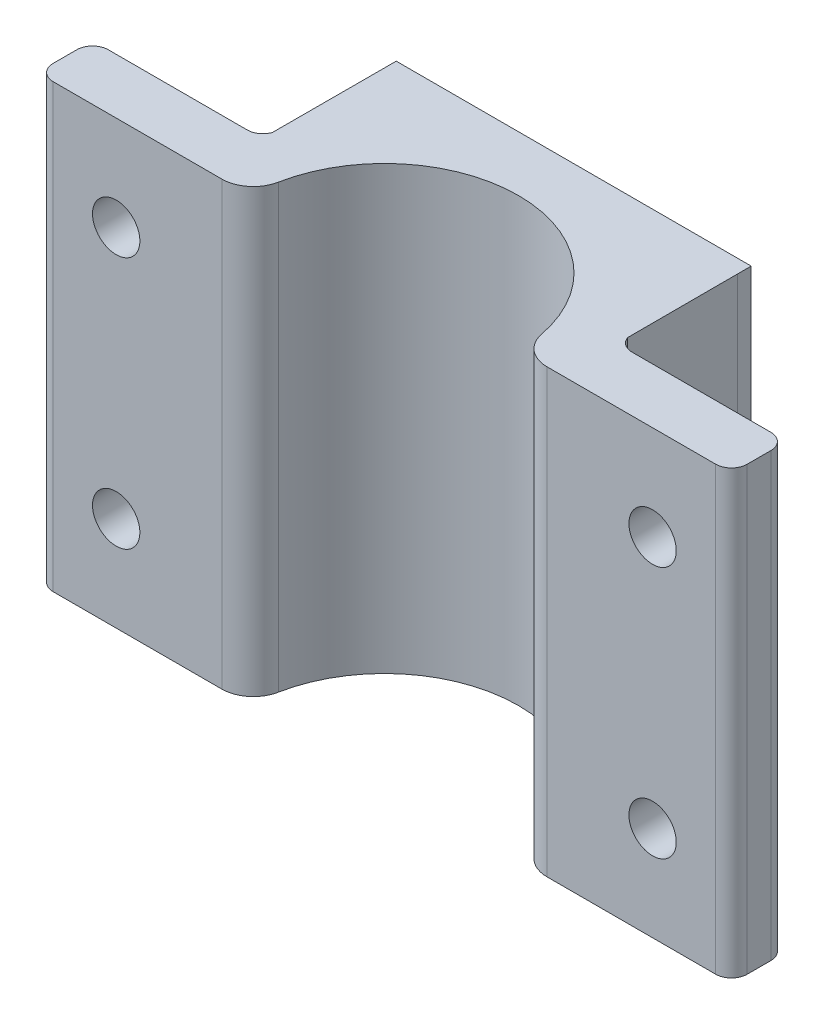
ISO-10303-21;
HEADER;
FILE_DESCRIPTION(('STEP AP214'),'2;1');
FILE_NAME('part.step','',(''),(''),'','','');
FILE_SCHEMA(('AUTOMOTIVE_DESIGN { 1 0 10303 214 1 1 1 1 }'));
ENDSEC;
DATA;
#1=APPLICATION_CONTEXT('core data for automotive mechanical design processes');
#2=APPLICATION_PROTOCOL_DEFINITION('international standard','automotive_design',2000,#1);
#3=PRODUCT_CONTEXT('',#1,'mechanical');
#4=PRODUCT('Part','Part','',(#3));
#5=PRODUCT_RELATED_PRODUCT_CATEGORY('part','',(#4));
#6=PRODUCT_DEFINITION_FORMATION('','',#4);
#7=PRODUCT_DEFINITION_CONTEXT('part definition',#1,'design');
#8=PRODUCT_DEFINITION('design','',#6,#7);
#9=PRODUCT_DEFINITION_SHAPE('','',#8);
#10=(LENGTH_UNIT() NAMED_UNIT(*) SI_UNIT(.MILLI.,.METRE.));
#11=(NAMED_UNIT(*) PLANE_ANGLE_UNIT() SI_UNIT($,.RADIAN.));
#12=(NAMED_UNIT(*) SI_UNIT($,.STERADIAN.) SOLID_ANGLE_UNIT());
#13=UNCERTAINTY_MEASURE_WITH_UNIT(LENGTH_MEASURE(1.E-05),#10,'distance_accuracy_value','');
#14=(GEOMETRIC_REPRESENTATION_CONTEXT(3) GLOBAL_UNCERTAINTY_ASSIGNED_CONTEXT((#13)) GLOBAL_UNIT_ASSIGNED_CONTEXT((#10,
#11,#12)) REPRESENTATION_CONTEXT('',''));
#15=CARTESIAN_POINT('',(0.,0.,0.));
#16=DIRECTION('',(0.,0.,1.));
#17=DIRECTION('',(1.,0.,0.));
#18=AXIS2_PLACEMENT_3D('',#15,#16,#17);
#19=CARTESIAN_POINT('',(11.478240283249,28.,-3.5));
#20=DIRECTION('',(0.,0.,1.));
#21=DIRECTION('',(1.,0.,0.));
#22=AXIS2_PLACEMENT_3D('',#19,#20,#21);
#23=PLANE('',#22);
#24=CARTESIAN_POINT('',(17.,22.,-3.5));
#25=DIRECTION('',(0.,0.,-1.));
#26=DIRECTION('',(-1.,0.,0.));
#27=AXIS2_PLACEMENT_3D('',#24,#25,#26);
#28=CIRCLE('',#27,1.5);
#29=CARTESIAN_POINT('',(15.5,22.,-3.5));
#30=VERTEX_POINT('',#29);
#31=EDGE_CURVE('E470',#30,#30,#28,.T.);
#32=ORIENTED_EDGE('',*,*,#31,.F.);
#33=EDGE_LOOP('',(#32));
#34=FACE_BOUND('',#33,.T.);
#35=DIRECTION('',(-1.,0.,0.));
#36=VECTOR('',#35,1.);
#37=CARTESIAN_POINT('',(11.478240283249,28.,-3.5));
#38=LINE('',#37,#36);
#39=CARTESIAN_POINT('',(21.,28.,-3.5));
#40=VERTEX_POINT('',#39);
#41=CARTESIAN_POINT('',(12.1963109176505,28.,-3.5));
#42=VERTEX_POINT('',#41);
#43=EDGE_CURVE('E238',#40,#42,#38,.T.);
#44=ORIENTED_EDGE('',*,*,#43,.F.);
#45=DIRECTION('',(0.,-1.,0.));
#46=VECTOR('',#45,1.);
#47=CARTESIAN_POINT('',(21.,28.,-3.5));
#48=LINE('',#47,#46);
#49=CARTESIAN_POINT('',(21.,0.,-3.5));
#50=VERTEX_POINT('',#49);
#51=EDGE_CURVE('E11',#40,#50,#48,.T.);
#52=ORIENTED_EDGE('',*,*,#51,.T.);
#53=DIRECTION('',(-1.,0.,0.));
#54=VECTOR('',#53,1.);
#55=CARTESIAN_POINT('',(11.478240283249,0.,-3.5));
#56=LINE('',#55,#54);
#57=CARTESIAN_POINT('',(12.1963109176505,0.,-3.5));
#58=VERTEX_POINT('',#57);
#59=EDGE_CURVE('E256',#50,#58,#56,.T.);
#60=ORIENTED_EDGE('',*,*,#59,.T.);
#61=DIRECTION('',(0.,1.,0.));
#62=VECTOR('',#61,1.);
#63=CARTESIAN_POINT('',(12.1963109176505,28.,-3.5));
#64=LINE('',#63,#62);
#65=EDGE_CURVE('E287',#58,#42,#64,.T.);
#66=ORIENTED_EDGE('',*,*,#65,.T.);
#67=EDGE_LOOP('',(#44,#52,#60,#66));
#68=FACE_BOUND('',#67,.T.);
#69=CARTESIAN_POINT('',(17.,6.,-3.5));
#70=DIRECTION('',(0.,0.,-1.));
#71=DIRECTION('',(-1.,0.,0.));
#72=AXIS2_PLACEMENT_3D('',#69,#70,#71);
#73=CIRCLE('',#72,1.5);
#74=CARTESIAN_POINT('',(15.5,6.,-3.5));
#75=VERTEX_POINT('',#74);
#76=EDGE_CURVE('E481',#75,#75,#73,.T.);
#77=ORIENTED_EDGE('',*,*,#76,.F.);
#78=EDGE_LOOP('',(#77));
#79=FACE_BOUND('',#78,.T.);
#80=ADVANCED_FACE('F35',(#34,#68,#79),#23,.F.);
#81=CARTESIAN_POINT('',(0.,28.,0.));
#82=DIRECTION('',(0.,-1.,0.));
#83=DIRECTION('',(0.,0.,-1.));
#84=AXIS2_PLACEMENT_3D('',#81,#82,#83);
#85=CYLINDRICAL_SURFACE('',#84,8.5);
#86=CARTESIAN_POINT('',(0.,0.,0.));
#87=DIRECTION('',(0.,-1.,0.));
#88=DIRECTION('',(0.,0.,1.));
#89=AXIS2_PLACEMENT_3D('',#86,#87,#88);
#90=CIRCLE('',#89,8.5);
#91=CARTESIAN_POINT('',(-8.34438043279765,0.,-1.61904761904762));
#92=VERTEX_POINT('',#91);
#93=CARTESIAN_POINT('',(8.34438043279765,0.,-1.61904761904762));
#94=VERTEX_POINT('',#93);
#95=EDGE_CURVE('E224',#92,#94,#90,.T.);
#96=ORIENTED_EDGE('',*,*,#95,.T.);
#97=DIRECTION('',(0.,-1.,0.));
#98=VECTOR('',#97,1.);
#99=CARTESIAN_POINT('',(8.34438043279765,28.,-1.61904761904762));
#100=LINE('',#99,#98);
#101=CARTESIAN_POINT('',(8.34438043279765,28.,-1.61904761904762));
#102=VERTEX_POINT('',#101);
#103=EDGE_CURVE('E274',#94,#102,#100,.F.);
#104=ORIENTED_EDGE('',*,*,#103,.T.);
#105=CARTESIAN_POINT('',(0.,28.,0.));
#106=DIRECTION('',(0.,-1.,0.));
#107=DIRECTION('',(0.,0.,1.));
#108=AXIS2_PLACEMENT_3D('',#105,#106,#107);
#109=CIRCLE('',#108,8.5);
#110=CARTESIAN_POINT('',(-8.34438043279765,28.,-1.61904761904762));
#111=VERTEX_POINT('',#110);
#112=EDGE_CURVE('E229',#111,#102,#109,.T.);
#113=ORIENTED_EDGE('',*,*,#112,.F.);
#114=DIRECTION('',(0.,-1.,0.));
#115=VECTOR('',#114,1.);
#116=CARTESIAN_POINT('',(-8.34438043279765,28.,-1.61904761904762));
#117=LINE('',#116,#115);
#118=EDGE_CURVE('E271',#111,#92,#117,.T.);
#119=ORIENTED_EDGE('',*,*,#118,.T.);
#120=EDGE_LOOP('',(#96,#104,#113,#119));
#121=FACE_BOUND('',#120,.T.);
#122=ADVANCED_FACE('F370',(#121),#85,.F.);
#123=CARTESIAN_POINT('',(8.5,28.,0.));
#124=DIRECTION('',(0.,0.,-1.));
#125=DIRECTION('',(-1.,0.,0.));
#126=AXIS2_PLACEMENT_3D('',#123,#124,#125);
#127=PLANE('',#126);
#128=CARTESIAN_POINT('',(17.,22.,0.));
#129=DIRECTION('',(0.,0.,-1.));
#130=DIRECTION('',(-1.,0.,0.));
#131=AXIS2_PLACEMENT_3D('',#128,#129,#130);
#132=CIRCLE('',#131,1.5);
#133=CARTESIAN_POINT('',(15.5,22.,0.));
#134=VERTEX_POINT('',#133);
#135=EDGE_CURVE('E478',#134,#134,#132,.T.);
#136=ORIENTED_EDGE('',*,*,#135,.T.);
#137=EDGE_LOOP('',(#136));
#138=FACE_BOUND('',#137,.T.);
#139=CARTESIAN_POINT('',(17.,6.,0.));
#140=DIRECTION('',(0.,0.,-1.));
#141=DIRECTION('',(-1.,0.,0.));
#142=AXIS2_PLACEMENT_3D('',#139,#140,#141);
#143=CIRCLE('',#142,1.5);
#144=CARTESIAN_POINT('',(15.5,6.,0.));
#145=VERTEX_POINT('',#144);
#146=EDGE_CURVE('E484',#145,#145,#143,.T.);
#147=ORIENTED_EDGE('',*,*,#146,.T.);
#148=EDGE_LOOP('',(#147));
#149=FACE_BOUND('',#148,.T.);
#150=DIRECTION('',(1.,0.,0.));
#151=VECTOR('',#150,1.);
#152=CARTESIAN_POINT('',(8.5,0.,0.));
#153=LINE('',#152,#151);
#154=CARTESIAN_POINT('',(10.3077640640442,0.,0.));
#155=VERTEX_POINT('',#154);
#156=CARTESIAN_POINT('',(21.,0.,0.));
#157=VERTEX_POINT('',#156);
#158=EDGE_CURVE('E250',#155,#157,#153,.T.);
#159=ORIENTED_EDGE('',*,*,#158,.T.);
#160=DIRECTION('',(0.,-1.,0.));
#161=VECTOR('',#160,1.);
#162=CARTESIAN_POINT('',(21.,28.,0.));
#163=LINE('',#162,#161);
#164=CARTESIAN_POINT('',(21.,28.,0.));
#165=VERTEX_POINT('',#164);
#166=EDGE_CURVE('E43',#157,#165,#163,.F.);
#167=ORIENTED_EDGE('',*,*,#166,.T.);
#168=DIRECTION('',(1.,0.,0.));
#169=VECTOR('',#168,1.);
#170=CARTESIAN_POINT('',(8.5,28.,0.));
#171=LINE('',#170,#169);
#172=CARTESIAN_POINT('',(10.3077640640442,28.,0.));
#173=VERTEX_POINT('',#172);
#174=EDGE_CURVE('E232',#173,#165,#171,.T.);
#175=ORIENTED_EDGE('',*,*,#174,.F.);
#176=DIRECTION('',(0.,-1.,0.));
#177=VECTOR('',#176,1.);
#178=CARTESIAN_POINT('',(10.3077640640442,28.,0.));
#179=LINE('',#178,#177);
#180=EDGE_CURVE('E247',#173,#155,#179,.T.);
#181=ORIENTED_EDGE('',*,*,#180,.T.);
#182=EDGE_LOOP('',(#159,#167,#175,#181));
#183=FACE_BOUND('',#182,.T.);
#184=ADVANCED_FACE('F332',(#138,#149,#183),#127,.F.);
#185=CARTESIAN_POINT('',(22.,28.,0.));
#186=DIRECTION('',(-1.,0.,0.));
#187=DIRECTION('',(0.,0.,1.));
#188=AXIS2_PLACEMENT_3D('',#185,#186,#187);
#189=PLANE('',#188);
#190=DIRECTION('',(0.,0.,-1.));
#191=VECTOR('',#190,1.);
#192=CARTESIAN_POINT('',(22.,28.,0.));
#193=LINE('',#192,#191);
#194=CARTESIAN_POINT('',(22.,28.,-1.));
#195=VERTEX_POINT('',#194);
#196=CARTESIAN_POINT('',(22.,28.,-2.5));
#197=VERTEX_POINT('',#196);
#198=EDGE_CURVE('E236',#195,#197,#193,.T.);
#199=ORIENTED_EDGE('',*,*,#198,.F.);
#200=DIRECTION('',(0.,-1.,0.));
#201=VECTOR('',#200,1.);
#202=CARTESIAN_POINT('',(22.,28.,-1.));
#203=LINE('',#202,#201);
#204=CARTESIAN_POINT('',(22.,0.,-1.));
#205=VERTEX_POINT('',#204);
#206=EDGE_CURVE('E327',#195,#205,#203,.T.);
#207=ORIENTED_EDGE('',*,*,#206,.T.);
#208=DIRECTION('',(0.,0.,-1.));
#209=VECTOR('',#208,1.);
#210=CARTESIAN_POINT('',(22.,0.,0.));
#211=LINE('',#210,#209);
#212=CARTESIAN_POINT('',(22.,0.,-2.5));
#213=VERTEX_POINT('',#212);
#214=EDGE_CURVE('E253',#205,#213,#211,.T.);
#215=ORIENTED_EDGE('',*,*,#214,.T.);
#216=DIRECTION('',(0.,-1.,0.));
#217=VECTOR('',#216,1.);
#218=CARTESIAN_POINT('',(22.,28.,-2.5));
#219=LINE('',#218,#217);
#220=EDGE_CURVE('E325',#213,#197,#219,.F.);
#221=ORIENTED_EDGE('',*,*,#220,.T.);
#222=EDGE_LOOP('',(#199,#207,#215,#221));
#223=FACE_BOUND('',#222,.T.);
#224=ADVANCED_FACE('F344',(#223),#189,.F.);
#225=CARTESIAN_POINT('',(-22.,28.,-3.5));
#226=DIRECTION('',(0.,0.,1.));
#227=DIRECTION('',(1.,0.,0.));
#228=AXIS2_PLACEMENT_3D('',#225,#226,#227);
#229=PLANE('',#228);
#230=CARTESIAN_POINT('',(-17.,6.,-3.5));
#231=DIRECTION('',(0.,0.,-1.));
#232=DIRECTION('',(-1.,0.,0.));
#233=AXIS2_PLACEMENT_3D('',#230,#231,#232);
#234=CIRCLE('',#233,1.5);
#235=CARTESIAN_POINT('',(-18.5,6.,-3.5));
#236=VERTEX_POINT('',#235);
#237=EDGE_CURVE('E461',#236,#236,#234,.T.);
#238=ORIENTED_EDGE('',*,*,#237,.F.);
#239=EDGE_LOOP('',(#238));
#240=FACE_BOUND('',#239,.T.);
#241=CARTESIAN_POINT('',(-17.,22.,-3.5));
#242=DIRECTION('',(0.,0.,-1.));
#243=DIRECTION('',(-1.,0.,0.));
#244=AXIS2_PLACEMENT_3D('',#241,#242,#243);
#245=CIRCLE('',#244,1.5);
#246=CARTESIAN_POINT('',(-18.5,22.,-3.5));
#247=VERTEX_POINT('',#246);
#248=EDGE_CURVE('E464',#247,#247,#245,.T.);
#249=ORIENTED_EDGE('',*,*,#248,.F.);
#250=EDGE_LOOP('',(#249));
#251=FACE_BOUND('',#250,.T.);
#252=DIRECTION('',(-1.,0.,0.));
#253=VECTOR('',#252,1.);
#254=CARTESIAN_POINT('',(-22.,0.,-3.5));
#255=LINE('',#254,#253);
#256=CARTESIAN_POINT('',(-12.1963109176505,0.,-3.5));
#257=VERTEX_POINT('',#256);
#258=CARTESIAN_POINT('',(-21.,0.,-3.5));
#259=VERTEX_POINT('',#258);
#260=EDGE_CURVE('E258',#257,#259,#255,.T.);
#261=ORIENTED_EDGE('',*,*,#260,.T.);
#262=DIRECTION('',(0.,-1.,0.));
#263=VECTOR('',#262,1.);
#264=CARTESIAN_POINT('',(-21.,28.,-3.5));
#265=LINE('',#264,#263);
#266=CARTESIAN_POINT('',(-21.,28.,-3.5));
#267=VERTEX_POINT('',#266);
#268=EDGE_CURVE('E50',#259,#267,#265,.F.);
#269=ORIENTED_EDGE('',*,*,#268,.T.);
#270=DIRECTION('',(-1.,0.,0.));
#271=VECTOR('',#270,1.);
#272=CARTESIAN_POINT('',(-22.,28.,-3.5));
#273=LINE('',#272,#271);
#274=CARTESIAN_POINT('',(-12.1963109176505,28.,-3.5));
#275=VERTEX_POINT('',#274);
#276=EDGE_CURVE('E240',#275,#267,#273,.T.);
#277=ORIENTED_EDGE('',*,*,#276,.F.);
#278=DIRECTION('',(0.,1.,0.));
#279=VECTOR('',#278,1.);
#280=CARTESIAN_POINT('',(-12.1963109176505,0.,-3.5));
#281=LINE('',#280,#279);
#282=EDGE_CURVE('E290',#275,#257,#281,.F.);
#283=ORIENTED_EDGE('',*,*,#282,.T.);
#284=EDGE_LOOP('',(#261,#269,#277,#283));
#285=FACE_BOUND('',#284,.T.);
#286=ADVANCED_FACE('F381',(#240,#251,#285),#229,.F.);
#287=CARTESIAN_POINT('',(-22.,28.,0.));
#288=DIRECTION('',(1.,0.,0.));
#289=DIRECTION('',(0.,0.,-1.));
#290=AXIS2_PLACEMENT_3D('',#287,#288,#289);
#291=PLANE('',#290);
#292=DIRECTION('',(0.,0.,1.));
#293=VECTOR('',#292,1.);
#294=CARTESIAN_POINT('',(-22.,0.,0.));
#295=LINE('',#294,#293);
#296=CARTESIAN_POINT('',(-22.,0.,-2.5));
#297=VERTEX_POINT('',#296);
#298=CARTESIAN_POINT('',(-22.,0.,-1.));
#299=VERTEX_POINT('',#298);
#300=EDGE_CURVE('E260',#297,#299,#295,.T.);
#301=ORIENTED_EDGE('',*,*,#300,.T.);
#302=DIRECTION('',(0.,-1.,0.));
#303=VECTOR('',#302,1.);
#304=CARTESIAN_POINT('',(-22.,28.,-1.));
#305=LINE('',#304,#303);
#306=CARTESIAN_POINT('',(-22.,28.,-1.));
#307=VERTEX_POINT('',#306);
#308=EDGE_CURVE('E315',#299,#307,#305,.F.);
#309=ORIENTED_EDGE('',*,*,#308,.T.);
#310=DIRECTION('',(0.,0.,1.));
#311=VECTOR('',#310,1.);
#312=CARTESIAN_POINT('',(-22.,28.,0.));
#313=LINE('',#312,#311);
#314=CARTESIAN_POINT('',(-22.,28.,-2.5));
#315=VERTEX_POINT('',#314);
#316=EDGE_CURVE('E242',#315,#307,#313,.T.);
#317=ORIENTED_EDGE('',*,*,#316,.F.);
#318=DIRECTION('',(0.,-1.,0.));
#319=VECTOR('',#318,1.);
#320=CARTESIAN_POINT('',(-22.,28.,-2.5));
#321=LINE('',#320,#319);
#322=EDGE_CURVE('E312',#315,#297,#321,.T.);
#323=ORIENTED_EDGE('',*,*,#322,.T.);
#324=EDGE_LOOP('',(#301,#309,#317,#323));
#325=FACE_BOUND('',#324,.T.);
#326=ADVANCED_FACE('F410',(#325),#291,.F.);
#327=CARTESIAN_POINT('',(-22.,28.,0.));
#328=DIRECTION('',(0.,0.,-1.));
#329=DIRECTION('',(-1.,0.,0.));
#330=AXIS2_PLACEMENT_3D('',#327,#328,#329);
#331=PLANE('',#330);
#332=CARTESIAN_POINT('',(-17.,6.,0.));
#333=DIRECTION('',(0.,0.,-1.));
#334=DIRECTION('',(-1.,0.,0.));
#335=AXIS2_PLACEMENT_3D('',#332,#333,#334);
#336=CIRCLE('',#335,1.5);
#337=CARTESIAN_POINT('',(-18.5,6.,0.));
#338=VERTEX_POINT('',#337);
#339=EDGE_CURVE('E467',#338,#338,#336,.T.);
#340=ORIENTED_EDGE('',*,*,#339,.T.);
#341=EDGE_LOOP('',(#340));
#342=FACE_BOUND('',#341,.T.);
#343=CARTESIAN_POINT('',(-17.,22.,0.));
#344=DIRECTION('',(0.,0.,-1.));
#345=DIRECTION('',(-1.,0.,0.));
#346=AXIS2_PLACEMENT_3D('',#343,#344,#345);
#347=CIRCLE('',#346,1.5);
#348=CARTESIAN_POINT('',(-18.5,22.,0.));
#349=VERTEX_POINT('',#348);
#350=EDGE_CURVE('E466',#349,#349,#347,.T.);
#351=ORIENTED_EDGE('',*,*,#350,.T.);
#352=EDGE_LOOP('',(#351));
#353=FACE_BOUND('',#352,.T.);
#354=DIRECTION('',(1.,0.,0.));
#355=VECTOR('',#354,1.);
#356=CARTESIAN_POINT('',(-22.,28.,0.));
#357=LINE('',#356,#355);
#358=CARTESIAN_POINT('',(-21.,28.,0.));
#359=VERTEX_POINT('',#358);
#360=CARTESIAN_POINT('',(-10.3077640640442,28.,0.));
#361=VERTEX_POINT('',#360);
#362=EDGE_CURVE('E245',#359,#361,#357,.T.);
#363=ORIENTED_EDGE('',*,*,#362,.F.);
#364=DIRECTION('',(0.,-1.,0.));
#365=VECTOR('',#364,1.);
#366=CARTESIAN_POINT('',(-21.,28.,0.));
#367=LINE('',#366,#365);
#368=CARTESIAN_POINT('',(-21.,0.,0.));
#369=VERTEX_POINT('',#368);
#370=EDGE_CURVE('E301',#359,#369,#367,.T.);
#371=ORIENTED_EDGE('',*,*,#370,.T.);
#372=DIRECTION('',(1.,0.,0.));
#373=VECTOR('',#372,1.);
#374=CARTESIAN_POINT('',(-22.,0.,0.));
#375=LINE('',#374,#373);
#376=CARTESIAN_POINT('',(-10.3077640640442,0.,0.));
#377=VERTEX_POINT('',#376);
#378=EDGE_CURVE('E233',#369,#377,#375,.T.);
#379=ORIENTED_EDGE('',*,*,#378,.T.);
#380=DIRECTION('',(0.,-1.,0.));
#381=VECTOR('',#380,1.);
#382=CARTESIAN_POINT('',(-10.3077640640442,28.,0.));
#383=LINE('',#382,#381);
#384=EDGE_CURVE('E280',#377,#361,#383,.F.);
#385=ORIENTED_EDGE('',*,*,#384,.T.);
#386=EDGE_LOOP('',(#363,#371,#379,#385));
#387=FACE_BOUND('',#386,.T.);
#388=ADVANCED_FACE('F403',(#342,#353,#387),#331,.F.);
#389=CARTESIAN_POINT('',(0.,28.,0.));
#390=DIRECTION('',(0.,1.,0.));
#391=DIRECTION('',(0.,0.,1.));
#392=AXIS2_PLACEMENT_3D('',#389,#390,#391);
#393=PLANE('',#392);
#394=ORIENTED_EDGE('',*,*,#316,.T.);
#395=CARTESIAN_POINT('',(-21.,28.,-1.));
#396=DIRECTION('',(0.,1.,0.));
#397=DIRECTION('',(0.,0.,1.));
#398=AXIS2_PLACEMENT_3D('',#395,#396,#397);
#399=CIRCLE('',#398,1.);
#400=EDGE_CURVE('E322',#307,#359,#399,.T.);
#401=ORIENTED_EDGE('',*,*,#400,.T.);
#402=ORIENTED_EDGE('',*,*,#362,.T.);
#403=CARTESIAN_POINT('',(-10.3077640640442,28.,-2.));
#404=DIRECTION('',(0.,1.,0.));
#405=DIRECTION('',(0.,0.,1.));
#406=AXIS2_PLACEMENT_3D('',#403,#404,#405);
#407=CIRCLE('',#406,2.);
#408=EDGE_CURVE('E276',#361,#111,#407,.T.);
#409=ORIENTED_EDGE('',*,*,#408,.T.);
#410=ORIENTED_EDGE('',*,*,#112,.T.);
#411=CARTESIAN_POINT('',(10.3077640640442,28.,-2.));
#412=DIRECTION('',(0.,1.,0.));
#413=DIRECTION('',(0.,0.,1.));
#414=AXIS2_PLACEMENT_3D('',#411,#412,#413);
#415=CIRCLE('',#414,2.);
#416=EDGE_CURVE('E278',#102,#173,#415,.T.);
#417=ORIENTED_EDGE('',*,*,#416,.T.);
#418=ORIENTED_EDGE('',*,*,#174,.T.);
#419=CARTESIAN_POINT('',(21.,28.,-1.));
#420=DIRECTION('',(0.,1.,0.));
#421=DIRECTION('',(0.,0.,1.));
#422=AXIS2_PLACEMENT_3D('',#419,#420,#421);
#423=CIRCLE('',#422,1.);
#424=EDGE_CURVE('E318',#165,#195,#423,.T.);
#425=ORIENTED_EDGE('',*,*,#424,.T.);
#426=ORIENTED_EDGE('',*,*,#198,.T.);
#427=CARTESIAN_POINT('',(21.,28.,-2.5));
#428=DIRECTION('',(0.,1.,0.));
#429=DIRECTION('',(0.,0.,1.));
#430=AXIS2_PLACEMENT_3D('',#427,#428,#429);
#431=CIRCLE('',#430,1.);
#432=EDGE_CURVE('E58',#197,#40,#431,.T.);
#433=ORIENTED_EDGE('',*,*,#432,.T.);
#434=ORIENTED_EDGE('',*,*,#43,.T.);
#435=CARTESIAN_POINT('',(12.1963109176505,28.,-4.5));
#436=DIRECTION('',(0.,1.,0.));
#437=DIRECTION('',(0.,0.,1.));
#438=AXIS2_PLACEMENT_3D('',#435,#436,#437);
#439=CIRCLE('',#438,1.);
#440=CARTESIAN_POINT('',(11.2581331547543,28.,-4.15384615384615));
#441=VERTEX_POINT('',#440);
#442=EDGE_CURVE('E295',#42,#441,#439,.F.);
#443=ORIENTED_EDGE('',*,*,#442,.T.);
#444=DIRECTION('',(0.00116313587934508,0.,0.999999323557234));
#445=VECTOR('',#444,1.);
#446=CARTESIAN_POINT('',(11.2629494080246,28.,-0.0131003494253584));
#447=LINE('',#446,#445);
#448=CARTESIAN_POINT('',(11.25,28.,-11.1462787639081));
#449=VERTEX_POINT('',#448);
#450=EDGE_CURVE('E212',#449,#441,#447,.T.);
#451=ORIENTED_EDGE('',*,*,#450,.F.);
#452=DIRECTION('',(0.,0.,-1.));
#453=VECTOR('',#452,1.);
#454=CARTESIAN_POINT('',(11.25,28.,0.));
#455=LINE('',#454,#453);
#456=CARTESIAN_POINT('',(11.25,28.,-12.));
#457=VERTEX_POINT('',#456);
#458=EDGE_CURVE('E182',#449,#457,#455,.T.);
#459=ORIENTED_EDGE('',*,*,#458,.T.);
#460=DIRECTION('',(1.,0.,0.));
#461=VECTOR('',#460,1.);
#462=CARTESIAN_POINT('',(0.,28.,-12.));
#463=LINE('',#462,#461);
#464=CARTESIAN_POINT('',(-11.25,28.,-12.));
#465=VERTEX_POINT('',#464);
#466=EDGE_CURVE('E216',#465,#457,#463,.T.);
#467=ORIENTED_EDGE('',*,*,#466,.F.);
#468=DIRECTION('',(0.,0.,-1.));
#469=VECTOR('',#468,1.);
#470=CARTESIAN_POINT('',(-11.25,28.,0.));
#471=LINE('',#470,#469);
#472=CARTESIAN_POINT('',(-11.25,28.,-11.1462787639081));
#473=VERTEX_POINT('',#472);
#474=EDGE_CURVE('E218',#473,#465,#471,.T.);
#475=ORIENTED_EDGE('',*,*,#474,.F.);
#476=DIRECTION('',(-0.00116313587934508,0.,0.999999323557234));
#477=VECTOR('',#476,1.);
#478=CARTESIAN_POINT('',(-11.2629494080246,28.,-0.0131003494253584));
#479=LINE('',#478,#477);
#480=CARTESIAN_POINT('',(-11.2581331547543,28.,-4.15384615384615));
#481=VERTEX_POINT('',#480);
#482=EDGE_CURVE('E197',#473,#481,#479,.T.);
#483=ORIENTED_EDGE('',*,*,#482,.T.);
#484=CARTESIAN_POINT('',(-12.1963109176505,28.,-4.5));
#485=DIRECTION('',(0.,1.,0.));
#486=DIRECTION('',(0.,0.,1.));
#487=AXIS2_PLACEMENT_3D('',#484,#485,#486);
#488=CIRCLE('',#487,1.);
#489=EDGE_CURVE('E299',#481,#275,#488,.F.);
#490=ORIENTED_EDGE('',*,*,#489,.T.);
#491=ORIENTED_EDGE('',*,*,#276,.T.);
#492=CARTESIAN_POINT('',(-21.,28.,-2.5));
#493=DIRECTION('',(0.,1.,0.));
#494=DIRECTION('',(0.,0.,1.));
#495=AXIS2_PLACEMENT_3D('',#492,#493,#494);
#496=CIRCLE('',#495,1.);
#497=EDGE_CURVE('E320',#267,#315,#496,.T.);
#498=ORIENTED_EDGE('',*,*,#497,.T.);
#499=EDGE_LOOP('',(#394,#401,#402,#409,#410,#417,#418,#425,#426,#433,#434,#443,#451,#459,#467,
#475,#483,#490,#491,#498));
#500=FACE_BOUND('',#499,.T.);
#501=ADVANCED_FACE('F337',(#500),#393,.T.);
#502=CARTESIAN_POINT('',(0.,0.,0.));
#503=DIRECTION('',(0.,1.,0.));
#504=DIRECTION('',(0.,0.,1.));
#505=AXIS2_PLACEMENT_3D('',#502,#503,#504);
#506=PLANE('',#505);
#507=ORIENTED_EDGE('',*,*,#378,.F.);
#508=CARTESIAN_POINT('',(-21.,0.,-1.));
#509=DIRECTION('',(0.,1.,0.));
#510=DIRECTION('',(0.,0.,1.));
#511=AXIS2_PLACEMENT_3D('',#508,#509,#510);
#512=CIRCLE('',#511,1.);
#513=EDGE_CURVE('E310',#369,#299,#512,.F.);
#514=ORIENTED_EDGE('',*,*,#513,.T.);
#515=ORIENTED_EDGE('',*,*,#300,.F.);
#516=CARTESIAN_POINT('',(-21.,0.,-2.5));
#517=DIRECTION('',(0.,1.,0.));
#518=DIRECTION('',(0.,0.,1.));
#519=AXIS2_PLACEMENT_3D('',#516,#517,#518);
#520=CIRCLE('',#519,1.);
#521=EDGE_CURVE('E308',#297,#259,#520,.F.);
#522=ORIENTED_EDGE('',*,*,#521,.T.);
#523=ORIENTED_EDGE('',*,*,#260,.F.);
#524=CARTESIAN_POINT('',(-12.1963109176505,0.,-4.5));
#525=DIRECTION('',(0.,1.,0.));
#526=DIRECTION('',(0.,0.,1.));
#527=AXIS2_PLACEMENT_3D('',#524,#525,#526);
#528=CIRCLE('',#527,1.);
#529=CARTESIAN_POINT('',(-11.2581331547543,0.,-4.15384615384615));
#530=VERTEX_POINT('',#529);
#531=EDGE_CURVE('E297',#257,#530,#528,.T.);
#532=ORIENTED_EDGE('',*,*,#531,.T.);
#533=DIRECTION('',(-0.00116313587934508,0.,0.999999323557234));
#534=VECTOR('',#533,1.);
#535=CARTESIAN_POINT('',(-11.2629494080246,0.,-0.0131003494253584));
#536=LINE('',#535,#534);
#537=CARTESIAN_POINT('',(-11.25,0.,-11.1462787639081));
#538=VERTEX_POINT('',#537);
#539=EDGE_CURVE('E187',#538,#530,#536,.T.);
#540=ORIENTED_EDGE('',*,*,#539,.F.);
#541=DIRECTION('',(0.,0.,-1.));
#542=VECTOR('',#541,1.);
#543=CARTESIAN_POINT('',(-11.25,0.,0.));
#544=LINE('',#543,#542);
#545=CARTESIAN_POINT('',(-11.25,0.,-12.));
#546=VERTEX_POINT('',#545);
#547=EDGE_CURVE('E205',#538,#546,#544,.T.);
#548=ORIENTED_EDGE('',*,*,#547,.T.);
#549=DIRECTION('',(1.,0.,0.));
#550=VECTOR('',#549,1.);
#551=CARTESIAN_POINT('',(0.,0.,-12.));
#552=LINE('',#551,#550);
#553=CARTESIAN_POINT('',(11.25,0.,-12.));
#554=VERTEX_POINT('',#553);
#555=EDGE_CURVE('E202',#546,#554,#552,.T.);
#556=ORIENTED_EDGE('',*,*,#555,.T.);
#557=DIRECTION('',(0.,0.,-1.));
#558=VECTOR('',#557,1.);
#559=CARTESIAN_POINT('',(11.25,0.,0.));
#560=LINE('',#559,#558);
#561=CARTESIAN_POINT('',(11.25,0.,-11.1462787639081));
#562=VERTEX_POINT('',#561);
#563=EDGE_CURVE('E180',#562,#554,#560,.T.);
#564=ORIENTED_EDGE('',*,*,#563,.F.);
#565=DIRECTION('',(0.00116313587934508,0.,0.999999323557234));
#566=VECTOR('',#565,1.);
#567=CARTESIAN_POINT('',(11.2629494080246,0.,-0.0131003494253584));
#568=LINE('',#567,#566);
#569=CARTESIAN_POINT('',(11.2581331547543,0.,-4.15384615384615));
#570=VERTEX_POINT('',#569);
#571=EDGE_CURVE('E191',#562,#570,#568,.T.);
#572=ORIENTED_EDGE('',*,*,#571,.T.);
#573=CARTESIAN_POINT('',(12.1963109176505,0.,-4.5));
#574=DIRECTION('',(0.,1.,0.));
#575=DIRECTION('',(0.,0.,1.));
#576=AXIS2_PLACEMENT_3D('',#573,#574,#575);
#577=CIRCLE('',#576,1.);
#578=EDGE_CURVE('E293',#570,#58,#577,.T.);
#579=ORIENTED_EDGE('',*,*,#578,.T.);
#580=ORIENTED_EDGE('',*,*,#59,.F.);
#581=CARTESIAN_POINT('',(21.,0.,-2.5));
#582=DIRECTION('',(0.,1.,0.));
#583=DIRECTION('',(0.,0.,1.));
#584=AXIS2_PLACEMENT_3D('',#581,#582,#583);
#585=CIRCLE('',#584,1.);
#586=EDGE_CURVE('E304',#50,#213,#585,.F.);
#587=ORIENTED_EDGE('',*,*,#586,.T.);
#588=ORIENTED_EDGE('',*,*,#214,.F.);
#589=CARTESIAN_POINT('',(21.,0.,-1.));
#590=DIRECTION('',(0.,1.,0.));
#591=DIRECTION('',(0.,0.,1.));
#592=AXIS2_PLACEMENT_3D('',#589,#590,#591);
#593=CIRCLE('',#592,1.);
#594=EDGE_CURVE('E306',#205,#157,#593,.F.);
#595=ORIENTED_EDGE('',*,*,#594,.T.);
#596=ORIENTED_EDGE('',*,*,#158,.F.);
#597=CARTESIAN_POINT('',(10.3077640640442,0.,-2.));
#598=DIRECTION('',(0.,1.,0.));
#599=DIRECTION('',(0.,0.,1.));
#600=AXIS2_PLACEMENT_3D('',#597,#598,#599);
#601=CIRCLE('',#600,2.);
#602=EDGE_CURVE('E269',#155,#94,#601,.F.);
#603=ORIENTED_EDGE('',*,*,#602,.T.);
#604=ORIENTED_EDGE('',*,*,#95,.F.);
#605=CARTESIAN_POINT('',(-10.3077640640442,0.,-2.));
#606=DIRECTION('',(0.,1.,0.));
#607=DIRECTION('',(0.,0.,1.));
#608=AXIS2_PLACEMENT_3D('',#605,#606,#607);
#609=CIRCLE('',#608,2.);
#610=EDGE_CURVE('E266',#92,#377,#609,.F.);
#611=ORIENTED_EDGE('',*,*,#610,.T.);
#612=EDGE_LOOP('',(#507,#514,#515,#522,#523,#532,#540,#548,#556,#564,#572,#579,#580,#587,#588,
#595,#596,#603,#604,#611));
#613=FACE_BOUND('',#612,.T.);
#614=ADVANCED_FACE('F200',(#613),#506,.F.);
#615=CARTESIAN_POINT('',(10.3077640640442,28.,-2.));
#616=DIRECTION('',(0.,-1.,0.));
#617=DIRECTION('',(0.,0.,-1.));
#618=AXIS2_PLACEMENT_3D('',#615,#616,#617);
#619=CYLINDRICAL_SURFACE('',#618,2.);
#620=ORIENTED_EDGE('',*,*,#416,.F.);
#621=ORIENTED_EDGE('',*,*,#103,.F.);
#622=ORIENTED_EDGE('',*,*,#602,.F.);
#623=ORIENTED_EDGE('',*,*,#180,.F.);
#624=EDGE_LOOP('',(#620,#621,#622,#623));
#625=FACE_BOUND('',#624,.T.);
#626=ADVANCED_FACE('F366',(#625),#619,.T.);
#627=CARTESIAN_POINT('',(-10.3077640640442,28.,-2.));
#628=DIRECTION('',(0.,-1.,0.));
#629=DIRECTION('',(0.,0.,-1.));
#630=AXIS2_PLACEMENT_3D('',#627,#628,#629);
#631=CYLINDRICAL_SURFACE('',#630,2.);
#632=ORIENTED_EDGE('',*,*,#408,.F.);
#633=ORIENTED_EDGE('',*,*,#384,.F.);
#634=ORIENTED_EDGE('',*,*,#610,.F.);
#635=ORIENTED_EDGE('',*,*,#118,.F.);
#636=EDGE_LOOP('',(#632,#633,#634,#635));
#637=FACE_BOUND('',#636,.T.);
#638=ADVANCED_FACE('F357',(#637),#631,.T.);
#639=CARTESIAN_POINT('',(12.1963109176505,28.,-4.5));
#640=DIRECTION('',(0.,-1.,0.));
#641=DIRECTION('',(0.,0.,-1.));
#642=AXIS2_PLACEMENT_3D('',#639,#640,#641);
#643=CYLINDRICAL_SURFACE('',#642,1.);
#644=ORIENTED_EDGE('',*,*,#442,.F.);
#645=ORIENTED_EDGE('',*,*,#65,.F.);
#646=ORIENTED_EDGE('',*,*,#578,.F.);
#647=DIRECTION('',(0.,-1.,0.));
#648=VECTOR('',#647,1.);
#649=CARTESIAN_POINT('',(11.2581331547543,28.,-4.15384615384615));
#650=LINE('',#649,#648);
#651=EDGE_CURVE('E194',#441,#570,#650,.T.);
#652=ORIENTED_EDGE('',*,*,#651,.F.);
#653=EDGE_LOOP('',(#644,#645,#646,#652));
#654=FACE_BOUND('',#653,.T.);
#655=ADVANCED_FACE('F354',(#654),#643,.F.);
#656=CARTESIAN_POINT('',(-12.1963109176505,28.,-4.5));
#657=DIRECTION('',(0.,-1.,0.));
#658=DIRECTION('',(0.,0.,-1.));
#659=AXIS2_PLACEMENT_3D('',#656,#657,#658);
#660=CYLINDRICAL_SURFACE('',#659,1.);
#661=ORIENTED_EDGE('',*,*,#489,.F.);
#662=DIRECTION('',(0.,-1.,0.));
#663=VECTOR('',#662,1.);
#664=CARTESIAN_POINT('',(-11.2581331547543,28.,-4.15384615384615));
#665=LINE('',#664,#663);
#666=EDGE_CURVE('E283',#530,#481,#665,.F.);
#667=ORIENTED_EDGE('',*,*,#666,.F.);
#668=ORIENTED_EDGE('',*,*,#531,.F.);
#669=ORIENTED_EDGE('',*,*,#282,.F.);
#670=EDGE_LOOP('',(#661,#667,#668,#669));
#671=FACE_BOUND('',#670,.T.);
#672=ADVANCED_FACE('F356',(#671),#660,.F.);
#673=CARTESIAN_POINT('',(-21.,28.,-1.));
#674=DIRECTION('',(0.,-1.,0.));
#675=DIRECTION('',(0.,0.,-1.));
#676=AXIS2_PLACEMENT_3D('',#673,#674,#675);
#677=CYLINDRICAL_SURFACE('',#676,1.);
#678=ORIENTED_EDGE('',*,*,#400,.F.);
#679=ORIENTED_EDGE('',*,*,#308,.F.);
#680=ORIENTED_EDGE('',*,*,#513,.F.);
#681=ORIENTED_EDGE('',*,*,#370,.F.);
#682=EDGE_LOOP('',(#678,#679,#680,#681));
#683=FACE_BOUND('',#682,.T.);
#684=ADVANCED_FACE('F363',(#683),#677,.T.);
#685=CARTESIAN_POINT('',(-21.,28.,-2.5));
#686=DIRECTION('',(0.,-1.,0.));
#687=DIRECTION('',(0.,0.,-1.));
#688=AXIS2_PLACEMENT_3D('',#685,#686,#687);
#689=CYLINDRICAL_SURFACE('',#688,1.);
#690=ORIENTED_EDGE('',*,*,#497,.F.);
#691=ORIENTED_EDGE('',*,*,#268,.F.);
#692=ORIENTED_EDGE('',*,*,#521,.F.);
#693=ORIENTED_EDGE('',*,*,#322,.F.);
#694=EDGE_LOOP('',(#690,#691,#692,#693));
#695=FACE_BOUND('',#694,.T.);
#696=ADVANCED_FACE('F414',(#695),#689,.T.);
#697=CARTESIAN_POINT('',(21.,28.,-1.));
#698=DIRECTION('',(0.,-1.,0.));
#699=DIRECTION('',(0.,0.,-1.));
#700=AXIS2_PLACEMENT_3D('',#697,#698,#699);
#701=CYLINDRICAL_SURFACE('',#700,1.);
#702=ORIENTED_EDGE('',*,*,#424,.F.);
#703=ORIENTED_EDGE('',*,*,#166,.F.);
#704=ORIENTED_EDGE('',*,*,#594,.F.);
#705=ORIENTED_EDGE('',*,*,#206,.F.);
#706=EDGE_LOOP('',(#702,#703,#704,#705));
#707=FACE_BOUND('',#706,.T.);
#708=ADVANCED_FACE('F341',(#707),#701,.T.);
#709=CARTESIAN_POINT('',(21.,28.,-2.5));
#710=DIRECTION('',(0.,-1.,0.));
#711=DIRECTION('',(0.,0.,-1.));
#712=AXIS2_PLACEMENT_3D('',#709,#710,#711);
#713=CYLINDRICAL_SURFACE('',#712,1.);
#714=ORIENTED_EDGE('',*,*,#432,.F.);
#715=ORIENTED_EDGE('',*,*,#220,.F.);
#716=ORIENTED_EDGE('',*,*,#586,.F.);
#717=ORIENTED_EDGE('',*,*,#51,.F.);
#718=EDGE_LOOP('',(#714,#715,#716,#717));
#719=FACE_BOUND('',#718,.T.);
#720=ADVANCED_FACE('F37',(#719),#713,.T.);
#721=CARTESIAN_POINT('',(0.,0.,-12.));
#722=DIRECTION('',(0.,0.,1.));
#723=DIRECTION('',(1.,0.,0.));
#724=AXIS2_PLACEMENT_3D('',#721,#722,#723);
#725=PLANE('',#724);
#726=CARTESIAN_POINT('',(7.62,3.2,-12.));
#727=DIRECTION('',(0.,0.,-1.));
#728=DIRECTION('',(1.,0.,0.));
#729=AXIS2_PLACEMENT_3D('',#726,#727,#728);
#730=CIRCLE('',#729,1.75);
#731=CARTESIAN_POINT('',(9.37,3.2,-12.));
#732=VERTEX_POINT('',#731);
#733=EDGE_CURVE('E487',#732,#732,#730,.T.);
#734=ORIENTED_EDGE('',*,*,#733,.F.);
#735=EDGE_LOOP('',(#734));
#736=FACE_BOUND('',#735,.T.);
#737=CARTESIAN_POINT('',(7.62,24.795,-12.));
#738=DIRECTION('',(0.,0.,-1.));
#739=DIRECTION('',(-1.,0.,0.));
#740=AXIS2_PLACEMENT_3D('',#737,#738,#739);
#741=CIRCLE('',#740,1.75);
#742=CARTESIAN_POINT('',(5.87,24.795,-12.));
#743=VERTEX_POINT('',#742);
#744=EDGE_CURVE('E498',#743,#743,#741,.T.);
#745=ORIENTED_EDGE('',*,*,#744,.F.);
#746=EDGE_LOOP('',(#745));
#747=FACE_BOUND('',#746,.T.);
#748=CARTESIAN_POINT('',(-7.62,24.795,-12.));
#749=DIRECTION('',(0.,0.,-1.));
#750=DIRECTION('',(1.,0.,0.));
#751=AXIS2_PLACEMENT_3D('',#748,#749,#750);
#752=CIRCLE('',#751,1.75);
#753=CARTESIAN_POINT('',(-5.87,24.795,-12.));
#754=VERTEX_POINT('',#753);
#755=EDGE_CURVE('E492',#754,#754,#752,.T.);
#756=ORIENTED_EDGE('',*,*,#755,.F.);
#757=EDGE_LOOP('',(#756));
#758=FACE_BOUND('',#757,.T.);
#759=CARTESIAN_POINT('',(-7.62,3.2,-12.));
#760=DIRECTION('',(0.,0.,-1.));
#761=DIRECTION('',(-1.,0.,0.));
#762=AXIS2_PLACEMENT_3D('',#759,#760,#761);
#763=CIRCLE('',#762,1.75);
#764=CARTESIAN_POINT('',(-9.37,3.2,-12.));
#765=VERTEX_POINT('',#764);
#766=EDGE_CURVE('E491',#765,#765,#763,.T.);
#767=ORIENTED_EDGE('',*,*,#766,.F.);
#768=EDGE_LOOP('',(#767));
#769=FACE_BOUND('',#768,.T.);
#770=ORIENTED_EDGE('',*,*,#466,.T.);
#771=DIRECTION('',(0.,1.,0.));
#772=VECTOR('',#771,1.);
#773=CARTESIAN_POINT('',(11.25,0.,-12.));
#774=LINE('',#773,#772);
#775=EDGE_CURVE('E186',#554,#457,#774,.T.);
#776=ORIENTED_EDGE('',*,*,#775,.F.);
#777=ORIENTED_EDGE('',*,*,#555,.F.);
#778=DIRECTION('',(0.,1.,0.));
#779=VECTOR('',#778,1.);
#780=CARTESIAN_POINT('',(-11.25,0.,-12.));
#781=LINE('',#780,#779);
#782=EDGE_CURVE('E225',#546,#465,#781,.T.);
#783=ORIENTED_EDGE('',*,*,#782,.T.);
#784=EDGE_LOOP('',(#770,#776,#777,#783));
#785=FACE_BOUND('',#784,.T.);
#786=ADVANCED_FACE('F429',(#736,#747,#758,#769,#785),#725,.F.);
#787=CARTESIAN_POINT('',(-11.2629494080246,0.,-0.0131003494253584));
#788=DIRECTION('',(-0.999999323557234,0.,-0.00116313587934508));
#789=DIRECTION('',(-0.00116313587934508,0.,0.999999323557234));
#790=AXIS2_PLACEMENT_3D('',#787,#788,#789);
#791=PLANE('',#790);
#792=ORIENTED_EDGE('',*,*,#482,.F.);
#793=DIRECTION('',(0.,1.,0.));
#794=VECTOR('',#793,1.);
#795=CARTESIAN_POINT('',(-11.25,0.,-11.1462787639081));
#796=LINE('',#795,#794);
#797=EDGE_CURVE('E222',#538,#473,#796,.T.);
#798=ORIENTED_EDGE('',*,*,#797,.F.);
#799=ORIENTED_EDGE('',*,*,#539,.T.);
#800=ORIENTED_EDGE('',*,*,#666,.T.);
#801=EDGE_LOOP('',(#792,#798,#799,#800));
#802=FACE_BOUND('',#801,.T.);
#803=ADVANCED_FACE('F423',(#802),#791,.T.);
#804=CARTESIAN_POINT('',(-11.25,0.,0.));
#805=DIRECTION('',(1.,0.,0.));
#806=DIRECTION('',(0.,0.,-1.));
#807=AXIS2_PLACEMENT_3D('',#804,#805,#806);
#808=PLANE('',#807);
#809=ORIENTED_EDGE('',*,*,#474,.T.);
#810=ORIENTED_EDGE('',*,*,#782,.F.);
#811=ORIENTED_EDGE('',*,*,#547,.F.);
#812=ORIENTED_EDGE('',*,*,#797,.T.);
#813=EDGE_LOOP('',(#809,#810,#811,#812));
#814=FACE_BOUND('',#813,.T.);
#815=ADVANCED_FACE('F426',(#814),#808,.F.);
#816=CARTESIAN_POINT('',(11.25,0.,0.));
#817=DIRECTION('',(1.,0.,0.));
#818=DIRECTION('',(0.,0.,-1.));
#819=AXIS2_PLACEMENT_3D('',#816,#817,#818);
#820=PLANE('',#819);
#821=ORIENTED_EDGE('',*,*,#458,.F.);
#822=DIRECTION('',(0.,1.,0.));
#823=VECTOR('',#822,1.);
#824=CARTESIAN_POINT('',(11.25,0.,-11.1462787639081));
#825=LINE('',#824,#823);
#826=EDGE_CURVE('E175',#562,#449,#825,.T.);
#827=ORIENTED_EDGE('',*,*,#826,.F.);
#828=ORIENTED_EDGE('',*,*,#563,.T.);
#829=ORIENTED_EDGE('',*,*,#775,.T.);
#830=EDGE_LOOP('',(#821,#827,#828,#829));
#831=FACE_BOUND('',#830,.T.);
#832=ADVANCED_FACE('F177',(#831),#820,.T.);
#833=CARTESIAN_POINT('',(11.2629494080246,0.,-0.0131003494253584));
#834=DIRECTION('',(-0.999999323557234,0.,0.00116313587934508));
#835=DIRECTION('',(0.00116313587934508,0.,0.999999323557234));
#836=AXIS2_PLACEMENT_3D('',#833,#834,#835);
#837=PLANE('',#836);
#838=ORIENTED_EDGE('',*,*,#450,.T.);
#839=ORIENTED_EDGE('',*,*,#651,.T.);
#840=ORIENTED_EDGE('',*,*,#571,.F.);
#841=ORIENTED_EDGE('',*,*,#826,.T.);
#842=EDGE_LOOP('',(#838,#839,#840,#841));
#843=FACE_BOUND('',#842,.T.);
#844=ADVANCED_FACE('F192',(#843),#837,.F.);
#845=CARTESIAN_POINT('',(-7.62,3.2,-8.5));
#846=DIRECTION('',(0.,0.,-1.));
#847=DIRECTION('',(-1.,0.,0.));
#848=AXIS2_PLACEMENT_3D('',#845,#846,#847);
#849=CYLINDRICAL_SURFACE('',#848,1.75);
#850=CARTESIAN_POINT('',(-7.62,3.2,-8.5));
#851=DIRECTION('',(0.,0.,-1.));
#852=DIRECTION('',(-1.,0.,0.));
#853=AXIS2_PLACEMENT_3D('',#850,#851,#852);
#854=CIRCLE('',#853,1.75);
#855=CARTESIAN_POINT('',(-9.37,3.2,-8.5));
#856=VERTEX_POINT('',#855);
#857=EDGE_CURVE('E214',#856,#856,#854,.T.);
#858=ORIENTED_EDGE('',*,*,#857,.F.);
#859=EDGE_LOOP('',(#858));
#860=FACE_BOUND('',#859,.T.);
#861=ORIENTED_EDGE('',*,*,#766,.T.);
#862=EDGE_LOOP('',(#861));
#863=FACE_BOUND('',#862,.T.);
#864=ADVANCED_FACE('F446',(#860,#863),#849,.F.);
#865=CARTESIAN_POINT('',(-7.62,3.2,-8.5));
#866=DIRECTION('',(0.,0.,-1.));
#867=DIRECTION('',(-1.,0.,0.));
#868=AXIS2_PLACEMENT_3D('',#865,#866,#867);
#869=PLANE('',#868);
#870=ORIENTED_EDGE('',*,*,#857,.T.);
#871=EDGE_LOOP('',(#870));
#872=FACE_BOUND('',#871,.T.);
#873=ADVANCED_FACE('F512',(#872),#869,.T.);
#874=CARTESIAN_POINT('',(-7.62,24.795,-8.5));
#875=DIRECTION('',(0.,0.,-1.));
#876=DIRECTION('',(-1.,0.,0.));
#877=AXIS2_PLACEMENT_3D('',#874,#875,#876);
#878=CYLINDRICAL_SURFACE('',#877,1.75);
#879=CARTESIAN_POINT('',(-7.62,24.795,-8.5));
#880=DIRECTION('',(0.,0.,-1.));
#881=DIRECTION('',(1.,0.,0.));
#882=AXIS2_PLACEMENT_3D('',#879,#880,#881);
#883=CIRCLE('',#882,1.75);
#884=CARTESIAN_POINT('',(-5.87,24.795,-8.5));
#885=VERTEX_POINT('',#884);
#886=EDGE_CURVE('E488',#885,#885,#883,.T.);
#887=ORIENTED_EDGE('',*,*,#886,.F.);
#888=EDGE_LOOP('',(#887));
#889=FACE_BOUND('',#888,.T.);
#890=ORIENTED_EDGE('',*,*,#755,.T.);
#891=EDGE_LOOP('',(#890));
#892=FACE_BOUND('',#891,.T.);
#893=ADVANCED_FACE('F518',(#889,#892),#878,.F.);
#894=CARTESIAN_POINT('',(-7.62,24.795,-8.5));
#895=DIRECTION('',(0.,0.,1.));
#896=DIRECTION('',(1.,0.,0.));
#897=AXIS2_PLACEMENT_3D('',#894,#895,#896);
#898=PLANE('',#897);
#899=ORIENTED_EDGE('',*,*,#886,.T.);
#900=EDGE_LOOP('',(#899));
#901=FACE_BOUND('',#900,.T.);
#902=ADVANCED_FACE('F536',(#901),#898,.F.);
#903=CARTESIAN_POINT('',(7.62,24.795,-8.5));
#904=DIRECTION('',(0.,0.,-1.));
#905=DIRECTION('',(-1.,0.,0.));
#906=AXIS2_PLACEMENT_3D('',#903,#904,#905);
#907=CYLINDRICAL_SURFACE('',#906,1.75);
#908=CARTESIAN_POINT('',(7.62,24.795,-8.5));
#909=DIRECTION('',(0.,0.,-1.));
#910=DIRECTION('',(-1.,0.,0.));
#911=AXIS2_PLACEMENT_3D('',#908,#909,#910);
#912=CIRCLE('',#911,1.75);
#913=CARTESIAN_POINT('',(5.87,24.795,-8.5));
#914=VERTEX_POINT('',#913);
#915=EDGE_CURVE('E495',#914,#914,#912,.T.);
#916=ORIENTED_EDGE('',*,*,#915,.F.);
#917=EDGE_LOOP('',(#916));
#918=FACE_BOUND('',#917,.T.);
#919=ORIENTED_EDGE('',*,*,#744,.T.);
#920=EDGE_LOOP('',(#919));
#921=FACE_BOUND('',#920,.T.);
#922=ADVANCED_FACE('F533',(#918,#921),#907,.F.);
#923=CARTESIAN_POINT('',(7.62,24.795,-8.5));
#924=DIRECTION('',(0.,0.,-1.));
#925=DIRECTION('',(-1.,0.,0.));
#926=AXIS2_PLACEMENT_3D('',#923,#924,#925);
#927=PLANE('',#926);
#928=ORIENTED_EDGE('',*,*,#915,.T.);
#929=EDGE_LOOP('',(#928));
#930=FACE_BOUND('',#929,.T.);
#931=ADVANCED_FACE('F527',(#930),#927,.T.);
#932=CARTESIAN_POINT('',(7.62,3.2,-8.5));
#933=DIRECTION('',(0.,0.,-1.));
#934=DIRECTION('',(-1.,0.,0.));
#935=AXIS2_PLACEMENT_3D('',#932,#933,#934);
#936=CYLINDRICAL_SURFACE('',#935,1.75);
#937=CARTESIAN_POINT('',(7.62,3.2,-8.5));
#938=DIRECTION('',(0.,0.,-1.));
#939=DIRECTION('',(1.,0.,0.));
#940=AXIS2_PLACEMENT_3D('',#937,#938,#939);
#941=CIRCLE('',#940,1.75);
#942=CARTESIAN_POINT('',(9.37,3.2,-8.5));
#943=VERTEX_POINT('',#942);
#944=EDGE_CURVE('E501',#943,#943,#941,.T.);
#945=ORIENTED_EDGE('',*,*,#944,.F.);
#946=EDGE_LOOP('',(#945));
#947=FACE_BOUND('',#946,.T.);
#948=ORIENTED_EDGE('',*,*,#733,.T.);
#949=EDGE_LOOP('',(#948));
#950=FACE_BOUND('',#949,.T.);
#951=ADVANCED_FACE('F523',(#947,#950),#936,.F.);
#952=CARTESIAN_POINT('',(7.62,3.2,-8.5));
#953=DIRECTION('',(0.,0.,1.));
#954=DIRECTION('',(1.,0.,0.));
#955=AXIS2_PLACEMENT_3D('',#952,#953,#954);
#956=PLANE('',#955);
#957=ORIENTED_EDGE('',*,*,#944,.T.);
#958=EDGE_LOOP('',(#957));
#959=FACE_BOUND('',#958,.T.);
#960=ADVANCED_FACE('F526',(#959),#956,.F.);
#961=CARTESIAN_POINT('',(17.,6.,-3.5));
#962=DIRECTION('',(0.,0.,-1.));
#963=DIRECTION('',(-1.,0.,0.));
#964=AXIS2_PLACEMENT_3D('',#961,#962,#963);
#965=CYLINDRICAL_SURFACE('',#964,1.5);
#966=ORIENTED_EDGE('',*,*,#146,.F.);
#967=EDGE_LOOP('',(#966));
#968=FACE_BOUND('',#967,.T.);
#969=ORIENTED_EDGE('',*,*,#76,.T.);
#970=EDGE_LOOP('',(#969));
#971=FACE_BOUND('',#970,.T.);
#972=ADVANCED_FACE('F531',(#968,#971),#965,.F.);
#973=CARTESIAN_POINT('',(17.,22.,-3.5));
#974=DIRECTION('',(0.,0.,-1.));
#975=DIRECTION('',(-1.,0.,0.));
#976=AXIS2_PLACEMENT_3D('',#973,#974,#975);
#977=CYLINDRICAL_SURFACE('',#976,1.5);
#978=ORIENTED_EDGE('',*,*,#135,.F.);
#979=EDGE_LOOP('',(#978));
#980=FACE_BOUND('',#979,.T.);
#981=ORIENTED_EDGE('',*,*,#31,.T.);
#982=EDGE_LOOP('',(#981));
#983=FACE_BOUND('',#982,.T.);
#984=ADVANCED_FACE('F549',(#980,#983),#977,.F.);
#985=CARTESIAN_POINT('',(-17.,22.,-3.5));
#986=DIRECTION('',(0.,0.,-1.));
#987=DIRECTION('',(-1.,0.,0.));
#988=AXIS2_PLACEMENT_3D('',#985,#986,#987);
#989=CYLINDRICAL_SURFACE('',#988,1.5);
#990=ORIENTED_EDGE('',*,*,#350,.F.);
#991=EDGE_LOOP('',(#990));
#992=FACE_BOUND('',#991,.T.);
#993=ORIENTED_EDGE('',*,*,#248,.T.);
#994=EDGE_LOOP('',(#993));
#995=FACE_BOUND('',#994,.T.);
#996=ADVANCED_FACE('F553',(#992,#995),#989,.F.);
#997=CARTESIAN_POINT('',(-17.,6.,-3.5));
#998=DIRECTION('',(0.,0.,-1.));
#999=DIRECTION('',(-1.,0.,0.));
#1000=AXIS2_PLACEMENT_3D('',#997,#998,#999);
#1001=CYLINDRICAL_SURFACE('',#1000,1.5);
#1002=ORIENTED_EDGE('',*,*,#339,.F.);
#1003=EDGE_LOOP('',(#1002));
#1004=FACE_BOUND('',#1003,.T.);
#1005=ORIENTED_EDGE('',*,*,#237,.T.);
#1006=EDGE_LOOP('',(#1005));
#1007=FACE_BOUND('',#1006,.T.);
#1008=ADVANCED_FACE('F557',(#1004,#1007),#1001,.F.);
#1009=CLOSED_SHELL('',(#80,#122,#184,#224,#286,#326,#388,#501,#614,#626,#638,#655,#672,#684,
#696,#708,#720,#786,#803,#815,#832,#844,#864,#873,#893,#902,#922,#931,#951,#960,#972,#984,#996,#1008));
#1010=MANIFOLD_SOLID_BREP('B2',#1009);
#1011=ADVANCED_BREP_SHAPE_REPRESENTATION('',(#18,#1010),#14);
#1012=SHAPE_DEFINITION_REPRESENTATION(#9,#1011);
ENDSEC;
END-ISO-10303-21;
